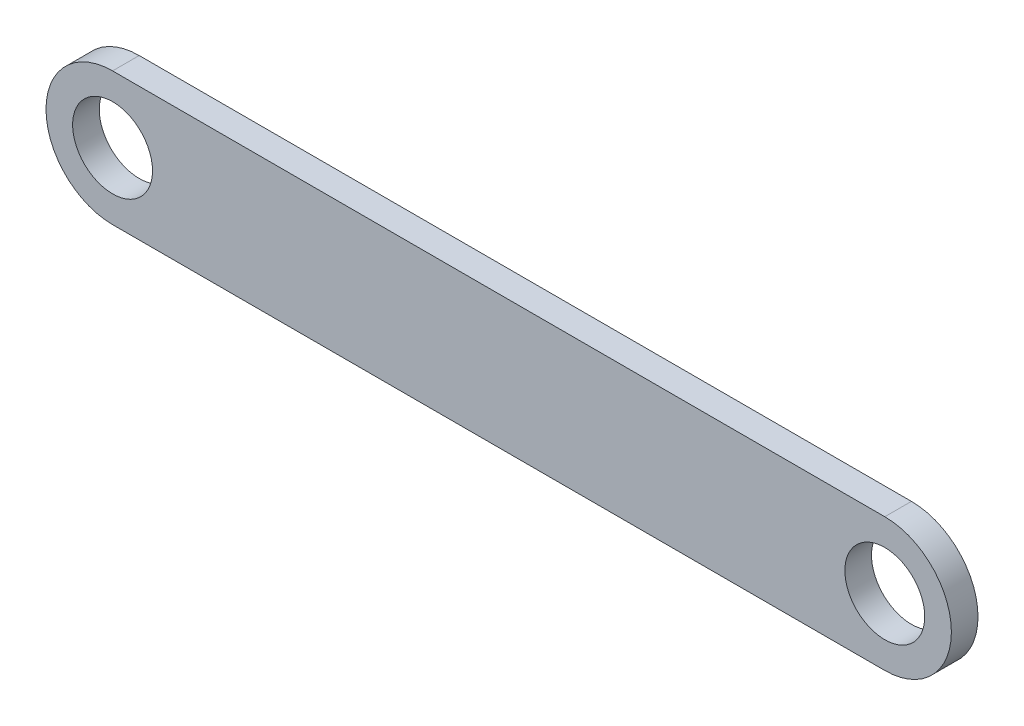
ISO-10303-21;
HEADER;
FILE_DESCRIPTION(('STEP AP214'),'2;1');
FILE_NAME('part.step','',(''),(''),'','','');
FILE_SCHEMA(('AUTOMOTIVE_DESIGN { 1 0 10303 214 1 1 1 1 }'));
ENDSEC;
DATA;
#1=APPLICATION_CONTEXT('core data for automotive mechanical design processes');
#2=APPLICATION_PROTOCOL_DEFINITION('international standard','automotive_design',2000,#1);
#3=PRODUCT_CONTEXT('',#1,'mechanical');
#4=PRODUCT('Part','Part','',(#3));
#5=PRODUCT_RELATED_PRODUCT_CATEGORY('part','',(#4));
#6=PRODUCT_DEFINITION_FORMATION('','',#4);
#7=PRODUCT_DEFINITION_CONTEXT('part definition',#1,'design');
#8=PRODUCT_DEFINITION('design','',#6,#7);
#9=PRODUCT_DEFINITION_SHAPE('','',#8);
#10=(LENGTH_UNIT() NAMED_UNIT(*) SI_UNIT(.MILLI.,.METRE.));
#11=(NAMED_UNIT(*) PLANE_ANGLE_UNIT() SI_UNIT($,.RADIAN.));
#12=(NAMED_UNIT(*) SI_UNIT($,.STERADIAN.) SOLID_ANGLE_UNIT());
#13=UNCERTAINTY_MEASURE_WITH_UNIT(LENGTH_MEASURE(1.E-05),#10,'distance_accuracy_value','');
#14=(GEOMETRIC_REPRESENTATION_CONTEXT(3) GLOBAL_UNCERTAINTY_ASSIGNED_CONTEXT((#13)) GLOBAL_UNIT_ASSIGNED_CONTEXT((#10,
#11,#12)) REPRESENTATION_CONTEXT('',''));
#15=CARTESIAN_POINT('',(0.,0.,0.));
#16=DIRECTION('',(0.,0.,1.));
#17=DIRECTION('',(1.,0.,0.));
#18=AXIS2_PLACEMENT_3D('',#15,#16,#17);
#19=CARTESIAN_POINT('',(0.,0.,2.5));
#20=DIRECTION('',(0.,0.,1.));
#21=DIRECTION('',(1.,0.,0.));
#22=AXIS2_PLACEMENT_3D('',#19,#20,#21);
#23=PLANE('',#22);
#24=CARTESIAN_POINT('',(0.,0.,2.5));
#25=DIRECTION('',(0.,0.,1.));
#26=DIRECTION('',(1.,0.,0.));
#27=AXIS2_PLACEMENT_3D('',#24,#25,#26);
#28=CIRCLE('',#27,7.5);
#29=CARTESIAN_POINT('',(7.5,0.,2.5));
#30=VERTEX_POINT('',#29);
#31=EDGE_CURVE('E101',#30,#30,#28,.T.);
#32=ORIENTED_EDGE('',*,*,#31,.F.);
#33=EDGE_LOOP('',(#32));
#34=FACE_BOUND('',#33,.T.);
#35=CARTESIAN_POINT('',(0.,0.,2.5));
#36=DIRECTION('',(0.,0.,1.));
#37=DIRECTION('',(1.,0.,0.));
#38=AXIS2_PLACEMENT_3D('',#35,#36,#37);
#39=CIRCLE('',#38,12.5);
#40=CARTESIAN_POINT('',(0.,12.5,2.5));
#41=VERTEX_POINT('',#40);
#42=CARTESIAN_POINT('',(0.,-12.5,2.5));
#43=VERTEX_POINT('',#42);
#44=EDGE_CURVE('E86',#41,#43,#39,.T.);
#45=ORIENTED_EDGE('',*,*,#44,.T.);
#46=DIRECTION('',(1.,0.,0.));
#47=VECTOR('',#46,1.);
#48=CARTESIAN_POINT('',(0.,-12.5,2.5));
#49=LINE('',#48,#47);
#50=CARTESIAN_POINT('',(145.,-12.5,2.5));
#51=VERTEX_POINT('',#50);
#52=EDGE_CURVE('E81',#43,#51,#49,.T.);
#53=ORIENTED_EDGE('',*,*,#52,.T.);
#54=CARTESIAN_POINT('',(145.,0.,2.5));
#55=DIRECTION('',(0.,0.,1.));
#56=DIRECTION('',(1.,0.,0.));
#57=AXIS2_PLACEMENT_3D('',#54,#55,#56);
#58=CIRCLE('',#57,12.5);
#59=CARTESIAN_POINT('',(145.,12.5,2.5));
#60=VERTEX_POINT('',#59);
#61=EDGE_CURVE('E84',#51,#60,#58,.T.);
#62=ORIENTED_EDGE('',*,*,#61,.T.);
#63=DIRECTION('',(-1.,0.,0.));
#64=VECTOR('',#63,1.);
#65=CARTESIAN_POINT('',(0.,12.5,2.5));
#66=LINE('',#65,#64);
#67=EDGE_CURVE('E51',#60,#41,#66,.T.);
#68=ORIENTED_EDGE('',*,*,#67,.T.);
#69=EDGE_LOOP('',(#45,#53,#62,#68));
#70=FACE_BOUND('',#69,.T.);
#71=CARTESIAN_POINT('',(145.,0.,2.5));
#72=DIRECTION('',(0.,0.,1.));
#73=DIRECTION('',(1.,0.,0.));
#74=AXIS2_PLACEMENT_3D('',#71,#72,#73);
#75=CIRCLE('',#74,7.50000000000001);
#76=CARTESIAN_POINT('',(152.5,0.,2.5));
#77=VERTEX_POINT('',#76);
#78=EDGE_CURVE('E116',#77,#77,#75,.T.);
#79=ORIENTED_EDGE('',*,*,#78,.F.);
#80=EDGE_LOOP('',(#79));
#81=FACE_BOUND('',#80,.T.);
#82=ADVANCED_FACE('F34',(#34,#70,#81),#23,.T.);
#83=CARTESIAN_POINT('',(0.,0.,-2.5));
#84=DIRECTION('',(0.,0.,1.));
#85=DIRECTION('',(1.,0.,0.));
#86=AXIS2_PLACEMENT_3D('',#83,#84,#85);
#87=PLANE('',#86);
#88=CARTESIAN_POINT('',(0.,0.,-2.5));
#89=DIRECTION('',(0.,0.,1.));
#90=DIRECTION('',(1.,0.,0.));
#91=AXIS2_PLACEMENT_3D('',#88,#89,#90);
#92=CIRCLE('',#91,12.5);
#93=CARTESIAN_POINT('',(0.,12.5,-2.5));
#94=VERTEX_POINT('',#93);
#95=CARTESIAN_POINT('',(0.,-12.5,-2.5));
#96=VERTEX_POINT('',#95);
#97=EDGE_CURVE('E98',#94,#96,#92,.T.);
#98=ORIENTED_EDGE('',*,*,#97,.F.);
#99=DIRECTION('',(-1.,0.,0.));
#100=VECTOR('',#99,1.);
#101=CARTESIAN_POINT('',(0.,12.5,-2.5));
#102=LINE('',#101,#100);
#103=CARTESIAN_POINT('',(145.,12.5,-2.5));
#104=VERTEX_POINT('',#103);
#105=EDGE_CURVE('E74',#104,#94,#102,.T.);
#106=ORIENTED_EDGE('',*,*,#105,.F.);
#107=CARTESIAN_POINT('',(145.,0.,-2.5));
#108=DIRECTION('',(0.,0.,1.));
#109=DIRECTION('',(1.,0.,0.));
#110=AXIS2_PLACEMENT_3D('',#107,#108,#109);
#111=CIRCLE('',#110,12.5);
#112=CARTESIAN_POINT('',(145.,-12.5,-2.5));
#113=VERTEX_POINT('',#112);
#114=EDGE_CURVE('E68',#113,#104,#111,.T.);
#115=ORIENTED_EDGE('',*,*,#114,.F.);
#116=DIRECTION('',(1.,0.,0.));
#117=VECTOR('',#116,1.);
#118=CARTESIAN_POINT('',(0.,-12.5,-2.5));
#119=LINE('',#118,#117);
#120=EDGE_CURVE('E90',#96,#113,#119,.T.);
#121=ORIENTED_EDGE('',*,*,#120,.F.);
#122=EDGE_LOOP('',(#98,#106,#115,#121));
#123=FACE_BOUND('',#122,.T.);
#124=CARTESIAN_POINT('',(0.,0.,-2.5));
#125=DIRECTION('',(0.,0.,1.));
#126=DIRECTION('',(1.,0.,0.));
#127=AXIS2_PLACEMENT_3D('',#124,#125,#126);
#128=CIRCLE('',#127,7.5);
#129=CARTESIAN_POINT('',(7.5,0.,-2.5));
#130=VERTEX_POINT('',#129);
#131=EDGE_CURVE('E113',#130,#130,#128,.T.);
#132=ORIENTED_EDGE('',*,*,#131,.T.);
#133=EDGE_LOOP('',(#132));
#134=FACE_BOUND('',#133,.T.);
#135=CARTESIAN_POINT('',(145.,0.,-2.5));
#136=DIRECTION('',(0.,0.,1.));
#137=DIRECTION('',(1.,0.,0.));
#138=AXIS2_PLACEMENT_3D('',#135,#136,#137);
#139=CIRCLE('',#138,7.50000000000001);
#140=CARTESIAN_POINT('',(152.5,0.,-2.5));
#141=VERTEX_POINT('',#140);
#142=EDGE_CURVE('E119',#141,#141,#139,.T.);
#143=ORIENTED_EDGE('',*,*,#142,.T.);
#144=EDGE_LOOP('',(#143));
#145=FACE_BOUND('',#144,.T.);
#146=ADVANCED_FACE('F109',(#123,#134,#145),#87,.F.);
#147=CARTESIAN_POINT('',(0.,0.,2.5));
#148=DIRECTION('',(0.,0.,-1.));
#149=DIRECTION('',(-1.,0.,0.));
#150=AXIS2_PLACEMENT_3D('',#147,#148,#149);
#151=CYLINDRICAL_SURFACE('',#150,12.5);
#152=ORIENTED_EDGE('',*,*,#97,.T.);
#153=DIRECTION('',(0.,0.,-1.));
#154=VECTOR('',#153,1.);
#155=CARTESIAN_POINT('',(0.,-12.5,2.5));
#156=LINE('',#155,#154);
#157=EDGE_CURVE('E11',#43,#96,#156,.T.);
#158=ORIENTED_EDGE('',*,*,#157,.F.);
#159=ORIENTED_EDGE('',*,*,#44,.F.);
#160=DIRECTION('',(0.,0.,-1.));
#161=VECTOR('',#160,1.);
#162=CARTESIAN_POINT('',(0.,12.5,2.5));
#163=LINE('',#162,#161);
#164=EDGE_CURVE('E94',#41,#94,#163,.T.);
#165=ORIENTED_EDGE('',*,*,#164,.T.);
#166=EDGE_LOOP('',(#152,#158,#159,#165));
#167=FACE_BOUND('',#166,.T.);
#168=ADVANCED_FACE('F36',(#167),#151,.T.);
#169=CARTESIAN_POINT('',(0.,-12.5,2.5));
#170=DIRECTION('',(0.,1.,0.));
#171=DIRECTION('',(-1.,0.,0.));
#172=AXIS2_PLACEMENT_3D('',#169,#170,#171);
#173=PLANE('',#172);
#174=ORIENTED_EDGE('',*,*,#120,.T.);
#175=DIRECTION('',(0.,0.,-1.));
#176=VECTOR('',#175,1.);
#177=CARTESIAN_POINT('',(145.,-12.5,2.5));
#178=LINE('',#177,#176);
#179=EDGE_CURVE('E43',#51,#113,#178,.T.);
#180=ORIENTED_EDGE('',*,*,#179,.F.);
#181=ORIENTED_EDGE('',*,*,#52,.F.);
#182=ORIENTED_EDGE('',*,*,#157,.T.);
#183=EDGE_LOOP('',(#174,#180,#181,#182));
#184=FACE_BOUND('',#183,.T.);
#185=ADVANCED_FACE('F89',(#184),#173,.F.);
#186=CARTESIAN_POINT('',(145.,0.,2.5));
#187=DIRECTION('',(0.,0.,-1.));
#188=DIRECTION('',(-1.,0.,0.));
#189=AXIS2_PLACEMENT_3D('',#186,#187,#188);
#190=CYLINDRICAL_SURFACE('',#189,12.5);
#191=ORIENTED_EDGE('',*,*,#114,.T.);
#192=DIRECTION('',(0.,0.,-1.));
#193=VECTOR('',#192,1.);
#194=CARTESIAN_POINT('',(145.,12.5,2.5));
#195=LINE('',#194,#193);
#196=EDGE_CURVE('E91',#60,#104,#195,.T.);
#197=ORIENTED_EDGE('',*,*,#196,.F.);
#198=ORIENTED_EDGE('',*,*,#61,.F.);
#199=ORIENTED_EDGE('',*,*,#179,.T.);
#200=EDGE_LOOP('',(#191,#197,#198,#199));
#201=FACE_BOUND('',#200,.T.);
#202=ADVANCED_FACE('F92',(#201),#190,.T.);
#203=CARTESIAN_POINT('',(0.,12.5,2.5));
#204=DIRECTION('',(0.,-1.,0.));
#205=DIRECTION('',(1.,0.,0.));
#206=AXIS2_PLACEMENT_3D('',#203,#204,#205);
#207=PLANE('',#206);
#208=ORIENTED_EDGE('',*,*,#105,.T.);
#209=ORIENTED_EDGE('',*,*,#164,.F.);
#210=ORIENTED_EDGE('',*,*,#67,.F.);
#211=ORIENTED_EDGE('',*,*,#196,.T.);
#212=EDGE_LOOP('',(#208,#209,#210,#211));
#213=FACE_BOUND('',#212,.T.);
#214=ADVANCED_FACE('F106',(#213),#207,.F.);
#215=CARTESIAN_POINT('',(0.,0.,2.5));
#216=DIRECTION('',(0.,0.,-1.));
#217=DIRECTION('',(-1.,0.,0.));
#218=AXIS2_PLACEMENT_3D('',#215,#216,#217);
#219=CYLINDRICAL_SURFACE('',#218,7.5);
#220=ORIENTED_EDGE('',*,*,#31,.T.);
#221=EDGE_LOOP('',(#220));
#222=FACE_BOUND('',#221,.T.);
#223=ORIENTED_EDGE('',*,*,#131,.F.);
#224=EDGE_LOOP('',(#223));
#225=FACE_BOUND('',#224,.T.);
#226=ADVANCED_FACE('F136',(#222,#225),#219,.F.);
#227=CARTESIAN_POINT('',(145.,0.,2.5));
#228=DIRECTION('',(0.,0.,-1.));
#229=DIRECTION('',(-1.,0.,0.));
#230=AXIS2_PLACEMENT_3D('',#227,#228,#229);
#231=CYLINDRICAL_SURFACE('',#230,7.50000000000001);
#232=ORIENTED_EDGE('',*,*,#78,.T.);
#233=EDGE_LOOP('',(#232));
#234=FACE_BOUND('',#233,.T.);
#235=ORIENTED_EDGE('',*,*,#142,.F.);
#236=EDGE_LOOP('',(#235));
#237=FACE_BOUND('',#236,.T.);
#238=ADVANCED_FACE('F125',(#234,#237),#231,.F.);
#239=CLOSED_SHELL('',(#82,#146,#168,#185,#202,#214,#226,#238));
#240=MANIFOLD_SOLID_BREP('B2',#239);
#241=ADVANCED_BREP_SHAPE_REPRESENTATION('',(#18,#240),#14);
#242=SHAPE_DEFINITION_REPRESENTATION(#9,#241);
ENDSEC;
END-ISO-10303-21;
